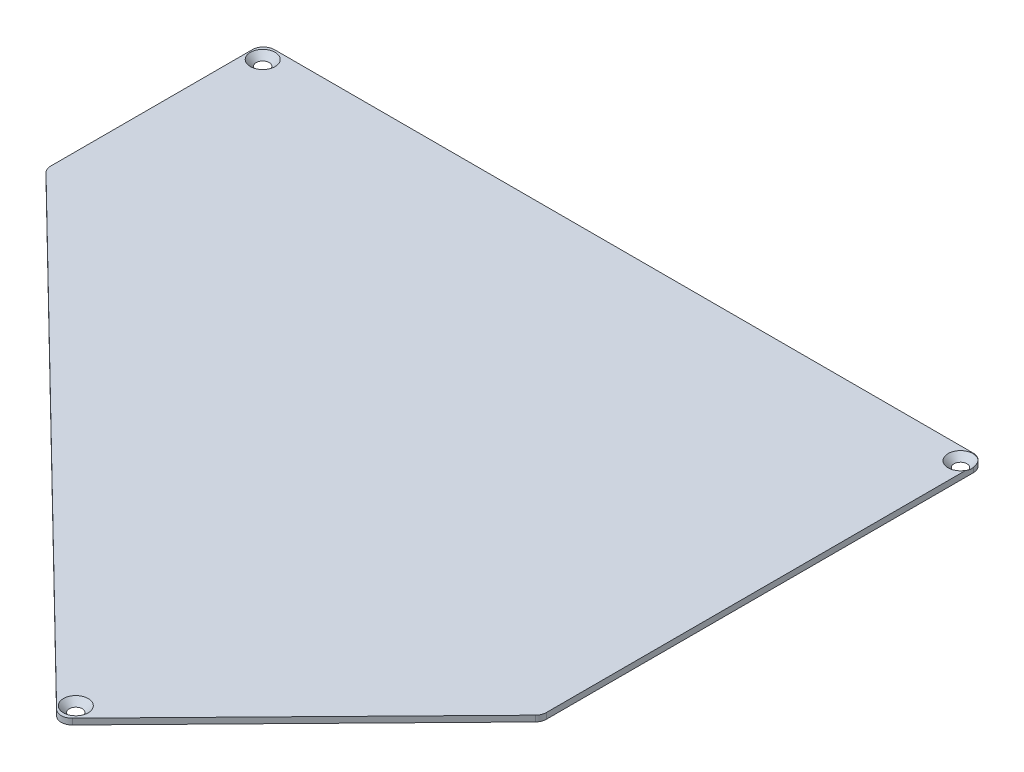
ISO-10303-21;
HEADER;
FILE_DESCRIPTION(('STEP AP214'),'2;1');
FILE_NAME('part.step','',(''),(''),'','','');
FILE_SCHEMA(('AUTOMOTIVE_DESIGN { 1 0 10303 214 1 1 1 1 }'));
ENDSEC;
DATA;
#1=APPLICATION_CONTEXT('core data for automotive mechanical design processes');
#2=APPLICATION_PROTOCOL_DEFINITION('international standard','automotive_design',2000,#1);
#3=PRODUCT_CONTEXT('',#1,'mechanical');
#4=PRODUCT('Part','Part','',(#3));
#5=PRODUCT_RELATED_PRODUCT_CATEGORY('part','',(#4));
#6=PRODUCT_DEFINITION_FORMATION('','',#4);
#7=PRODUCT_DEFINITION_CONTEXT('part definition',#1,'design');
#8=PRODUCT_DEFINITION('design','',#6,#7);
#9=PRODUCT_DEFINITION_SHAPE('','',#8);
#10=(LENGTH_UNIT() NAMED_UNIT(*) SI_UNIT(.MILLI.,.METRE.));
#11=(NAMED_UNIT(*) PLANE_ANGLE_UNIT() SI_UNIT($,.RADIAN.));
#12=(NAMED_UNIT(*) SI_UNIT($,.STERADIAN.) SOLID_ANGLE_UNIT());
#13=UNCERTAINTY_MEASURE_WITH_UNIT(LENGTH_MEASURE(1.E-05),#10,'distance_accuracy_value','');
#14=(GEOMETRIC_REPRESENTATION_CONTEXT(3) GLOBAL_UNCERTAINTY_ASSIGNED_CONTEXT((#13)) GLOBAL_UNIT_ASSIGNED_CONTEXT((#10,
#11,#12)) REPRESENTATION_CONTEXT('',''));
#15=CARTESIAN_POINT('',(0.,0.,0.));
#16=DIRECTION('',(0.,0.,1.));
#17=DIRECTION('',(1.,0.,0.));
#18=AXIS2_PLACEMENT_3D('',#15,#16,#17);
#19=CARTESIAN_POINT('',(83.0214751405466,1.5,72.4239902038868));
#20=DIRECTION('',(0.,-1.,0.));
#21=DIRECTION('',(0.,0.,-1.));
#22=AXIS2_PLACEMENT_3D('',#19,#20,#21);
#23=CYLINDRICAL_SURFACE('',#22,2.80000000000001);
#24=CARTESIAN_POINT('',(83.0214751405466,0.,72.4239902038868));
#25=DIRECTION('',(0.,1.,0.));
#26=DIRECTION('',(0.,0.,1.));
#27=AXIS2_PLACEMENT_3D('',#24,#25,#26);
#28=CIRCLE('',#27,2.80000000000001);
#29=CARTESIAN_POINT('',(81.0642976482748,0.,74.4263528742701));
#30=VERTEX_POINT('',#29);
#31=CARTESIAN_POINT('',(85.0238378109299,0.,74.3811676961587));
#32=VERTEX_POINT('',#31);
#33=EDGE_CURVE('E156',#30,#32,#28,.T.);
#34=ORIENTED_EDGE('',*,*,#33,.T.);
#35=DIRECTION('',(0.,-1.,0.));
#36=VECTOR('',#35,1.);
#37=CARTESIAN_POINT('',(85.0238378109299,1.5,74.3811676961587));
#38=LINE('',#37,#36);
#39=CARTESIAN_POINT('',(85.0238378109299,1.5,74.3811676961587));
#40=VERTEX_POINT('',#39);
#41=EDGE_CURVE('E11',#40,#32,#38,.T.);
#42=ORIENTED_EDGE('',*,*,#41,.F.);
#43=CARTESIAN_POINT('',(83.0214751405466,1.5,72.4239902038868));
#44=DIRECTION('',(0.,1.,0.));
#45=DIRECTION('',(0.,0.,1.));
#46=AXIS2_PLACEMENT_3D('',#43,#44,#45);
#47=CIRCLE('',#46,2.80000000000001);
#48=CARTESIAN_POINT('',(81.0642976482748,1.5,74.4263528742701));
#49=VERTEX_POINT('',#48);
#50=EDGE_CURVE('E177',#49,#40,#47,.T.);
#51=ORIENTED_EDGE('',*,*,#50,.F.);
#52=DIRECTION('',(0.,-1.,0.));
#53=VECTOR('',#52,1.);
#54=CARTESIAN_POINT('',(81.0642976482748,1.5,74.4263528742701));
#55=LINE('',#54,#53);
#56=EDGE_CURVE('E152',#49,#30,#55,.T.);
#57=ORIENTED_EDGE('',*,*,#56,.T.);
#58=EDGE_LOOP('',(#34,#42,#51,#57));
#59=FACE_BOUND('',#58,.T.);
#60=ADVANCED_FACE('F38',(#59),#23,.T.);
#61=CARTESIAN_POINT('',(85.0238378109299,1.5,74.3811676961587));
#62=DIRECTION('',(-0.715129525136879,0.,-0.698991961525668));
#63=DIRECTION('',(-0.698991961525668,0.,0.715129525136879));
#64=AXIS2_PLACEMENT_3D('',#61,#62,#63);
#65=PLANE('',#64);
#66=DIRECTION('',(0.698991961525668,0.,-0.715129525136879));
#67=VECTOR('',#66,1.);
#68=CARTESIAN_POINT('',(85.0238378109299,0.,74.3811676961587));
#69=LINE('',#68,#67);
#70=CARTESIAN_POINT('',(143.22520854545,0.,14.8361072281573));
#71=VERTEX_POINT('',#70);
#72=EDGE_CURVE('E159',#32,#71,#69,.T.);
#73=ORIENTED_EDGE('',*,*,#72,.T.);
#74=DIRECTION('',(0.,-1.,0.));
#75=VECTOR('',#74,1.);
#76=CARTESIAN_POINT('',(143.22520854545,1.5,14.8361072281573));
#77=LINE('',#76,#75);
#78=CARTESIAN_POINT('',(143.22520854545,1.5,14.8361072281573));
#79=VERTEX_POINT('',#78);
#80=EDGE_CURVE('E45',#79,#71,#77,.T.);
#81=ORIENTED_EDGE('',*,*,#80,.F.);
#82=DIRECTION('',(0.698991961525668,0.,-0.715129525136879));
#83=VECTOR('',#82,1.);
#84=CARTESIAN_POINT('',(85.0238378109299,1.5,74.3811676961587));
#85=LINE('',#84,#83);
#86=EDGE_CURVE('E108',#40,#79,#85,.T.);
#87=ORIENTED_EDGE('',*,*,#86,.F.);
#88=ORIENTED_EDGE('',*,*,#41,.T.);
#89=EDGE_LOOP('',(#73,#81,#87,#88));
#90=FACE_BOUND('',#89,.T.);
#91=ADVANCED_FACE('F289',(#90),#65,.F.);
#92=CARTESIAN_POINT('',(141.222845875067,1.5,12.8789297358855));
#93=DIRECTION('',(0.,-1.,0.));
#94=DIRECTION('',(0.,0.,-1.));
#95=AXIS2_PLACEMENT_3D('',#92,#93,#94);
#96=CYLINDRICAL_SURFACE('',#95,2.79999999999999);
#97=CARTESIAN_POINT('',(141.222845875067,0.,12.8789297358855));
#98=DIRECTION('',(0.,1.,0.));
#99=DIRECTION('',(0.,0.,1.));
#100=AXIS2_PLACEMENT_3D('',#97,#98,#99);
#101=CIRCLE('',#100,2.79999999999999);
#102=CARTESIAN_POINT('',(144.022845875067,0.,12.8789297358855));
#103=VERTEX_POINT('',#102);
#104=EDGE_CURVE('E162',#71,#103,#101,.T.);
#105=ORIENTED_EDGE('',*,*,#104,.T.);
#106=DIRECTION('',(0.,-1.,0.));
#107=VECTOR('',#106,1.);
#108=CARTESIAN_POINT('',(144.022845875067,1.5,12.8789297358855));
#109=LINE('',#108,#107);
#110=CARTESIAN_POINT('',(144.022845875067,1.5,12.8789297358855));
#111=VERTEX_POINT('',#110);
#112=EDGE_CURVE('E189',#111,#103,#109,.T.);
#113=ORIENTED_EDGE('',*,*,#112,.F.);
#114=CARTESIAN_POINT('',(141.222845875067,1.5,12.8789297358855));
#115=DIRECTION('',(0.,1.,0.));
#116=DIRECTION('',(0.,0.,1.));
#117=AXIS2_PLACEMENT_3D('',#114,#115,#116);
#118=CIRCLE('',#117,2.79999999999999);
#119=EDGE_CURVE('E197',#79,#111,#118,.T.);
#120=ORIENTED_EDGE('',*,*,#119,.F.);
#121=ORIENTED_EDGE('',*,*,#80,.T.);
#122=EDGE_LOOP('',(#105,#113,#120,#121));
#123=FACE_BOUND('',#122,.T.);
#124=ADVANCED_FACE('F195',(#123),#96,.T.);
#125=CARTESIAN_POINT('',(144.022845875067,1.5,12.8789297358855));
#126=DIRECTION('',(-1.,0.,0.));
#127=DIRECTION('',(0.,0.,1.));
#128=AXIS2_PLACEMENT_3D('',#125,#126,#127);
#129=PLANE('',#128);
#130=DIRECTION('',(0.,-1.,0.));
#131=VECTOR('',#130,1.);
#132=CARTESIAN_POINT('',(144.022845875067,1.5,-95.7041969985692));
#133=LINE('',#132,#131);
#134=CARTESIAN_POINT('',(144.022845875067,1.18781024153622,-95.7041969985692));
#135=VERTEX_POINT('',#134);
#136=CARTESIAN_POINT('',(144.022845875067,0.,-95.7041969985692));
#137=VERTEX_POINT('',#136);
#138=EDGE_CURVE('E187',#135,#137,#133,.T.);
#139=ORIENTED_EDGE('',*,*,#138,.F.);
#140=CARTESIAN_POINT('',(144.022845875067,2.5174754461105,-98.2968794308544));
#141=CARTESIAN_POINT('',(144.022845875067,2.4578416090348,-98.2164989542502));
#142=CARTESIAN_POINT('',(144.022845875067,2.39885674116238,-98.1356280249748));
#143=CARTESIAN_POINT('',(144.022845875067,2.28249146769985,-97.9727003048523));
#144=CARTESIAN_POINT('',(144.022845875067,2.22511160930745,-97.8906431236953));
#145=CARTESIAN_POINT('',(144.022845875067,2.1117175817814,-97.724332521911));
#146=CARTESIAN_POINT('',(144.022845875067,2.05572379084998,-97.6400651416734));
#147=CARTESIAN_POINT('',(144.022845875067,1.94619272788435,-97.4699580390067));
#148=CARTESIAN_POINT('',(144.022845875067,1.89265522120174,-97.3841184678695));
#149=CARTESIAN_POINT('',(144.022845875067,1.78642448155692,-97.2069653638458));
#150=CARTESIAN_POINT('',(144.022845875067,1.73386067612862,-97.1155731926114));
#151=CARTESIAN_POINT('',(144.022845875067,1.63289208972066,-96.9305295027223));
#152=CARTESIAN_POINT('',(144.022845875067,1.58448814813126,-96.8368775329383));
#153=CARTESIAN_POINT('',(144.022845875067,1.44750366393238,-96.5528402659925));
#154=CARTESIAN_POINT('',(144.022845875067,1.36657479774978,-96.3584546573322));
#155=CARTESIAN_POINT('',(144.022845875067,1.27812301382192,-96.0848830969306));
#156=CARTESIAN_POINT('',(144.022845875067,1.25646284576341,-96.0102177084435));
#157=CARTESIAN_POINT('',(144.022845875067,1.21832938605859,-95.8595309537962));
#158=CARTESIAN_POINT('',(144.022845875067,1.20185743588069,-95.7835092423044));
#159=CARTESIAN_POINT('',(144.022845875067,1.17487213352282,-95.6311607299349));
#160=CARTESIAN_POINT('',(144.022845875067,1.16430295587567,-95.5548439082205));
#161=CARTESIAN_POINT('',(144.022845875067,1.14934201222248,-95.4015847219888));
#162=CARTESIAN_POINT('',(144.022845875067,1.1449511809217,-95.3246422645913));
#163=CARTESIAN_POINT('',(144.022845875067,1.14267845930545,-95.1786177197707));
#164=CARTESIAN_POINT('',(144.022845875067,1.14417102264108,-95.1095447391086));
#165=CARTESIAN_POINT('',(144.022845875067,1.15222939710157,-94.9716951807934));
#166=CARTESIAN_POINT('',(144.022845875067,1.15879536773246,-94.9029186125277));
#167=CARTESIAN_POINT('',(144.022845875067,1.17678035605262,-94.7658498707027));
#168=CARTESIAN_POINT('',(144.022845875067,1.18821036090908,-94.6975591518754));
#169=CARTESIAN_POINT('',(144.022845875067,1.21553947112818,-94.5618812866275));
#170=CARTESIAN_POINT('',(144.022845875067,1.23143918856618,-94.4944942652828));
#171=CARTESIAN_POINT('',(144.022845875067,1.28236665023942,-94.3043598418632));
#172=CARTESIAN_POINT('',(144.022845875067,1.32221221602265,-94.1828926903758));
#173=CARTESIAN_POINT('',(144.022845875067,1.41252359585929,-93.9439736303907));
#174=CARTESIAN_POINT('',(144.022845875067,1.46299897963761,-93.8265254515731));
#175=CARTESIAN_POINT('',(144.022845875067,1.57258577452615,-93.5940653761977));
#176=CARTESIAN_POINT('',(144.022845875067,1.63179254752807,-93.4790989211615));
#177=CARTESIAN_POINT('',(144.022845875067,1.72517574794358,-93.3092375864666));
#178=CARTESIAN_POINT('',(144.022845875067,1.75705974428193,-93.2530580272296));
#179=CARTESIAN_POINT('',(144.022845875067,1.82216281942444,-93.1414805645701));
#180=CARTESIAN_POINT('',(144.022845875067,1.85538182966014,-93.0860826211997));
#181=CARTESIAN_POINT('',(144.022845875067,1.97134214727385,-92.8972201152352));
#182=CARTESIAN_POINT('',(144.022845875067,2.05691919806155,-92.7654946936719));
#183=CARTESIAN_POINT('',(144.022845875067,2.23300256673905,-92.5053663816018));
#184=CARTESIAN_POINT('',(144.022845875067,2.32351029669393,-92.3769644585855));
#185=CARTESIAN_POINT('',(144.022845875067,2.50825741338781,-92.122709015452));
#186=CARTESIAN_POINT('',(144.022845875067,2.60250005534075,-91.9968578695779));
#187=CARTESIAN_POINT('',(144.022845875067,2.79376317589313,-91.7472787555964));
#188=CARTESIAN_POINT('',(144.022845875067,2.89078386208582,-91.6235509472692));
#189=CARTESIAN_POINT('',(144.022845875067,3.08737539010931,-91.3773082826497));
#190=CARTESIAN_POINT('',(144.022845875067,3.18695507781303,-91.2548005062153));
#191=CARTESIAN_POINT('',(144.022845875067,3.3878268908647,-91.0111951304536));
#192=CARTESIAN_POINT('',(144.022845875067,3.4891190599987,-90.8900975673178));
#193=CARTESIAN_POINT('',(144.022845875067,3.79492014758252,-90.5286669456757));
#194=CARTESIAN_POINT('',(144.022845875067,4.00146540016445,-90.2900576627691));
#195=CARTESIAN_POINT('',(144.022845875067,4.39436468921282,-89.8431251264288));
#196=CARTESIAN_POINT('',(144.022845875067,4.58032878986242,-89.6344569349586));
#197=CARTESIAN_POINT('',(144.022845875067,4.95438151925747,-89.2189761856086));
#198=CARTESIAN_POINT('',(144.022845875067,5.14247047259345,-89.0121639201388));
#199=CARTESIAN_POINT('',(144.022845875067,5.5186505168506,-88.6016909436965));
#200=CARTESIAN_POINT('',(144.022845875067,5.70672863743755,-88.3980183216814));
#201=CARTESIAN_POINT('',(144.022845875067,6.08406279141988,-87.9918408677799));
#202=CARTESIAN_POINT('',(144.022845875067,6.27331858687651,-87.7893358149676));
#203=CARTESIAN_POINT('',(144.022845875067,6.46301733485952,-87.5872498864537));
#204=B_SPLINE_CURVE_WITH_KNOTS('',3,(#140,#141,#142,#143,#144,#145,#146,#147,#148,#149,#150,
#151,#152,#153,#154,#155,#156,#157,#158,#159,#160,#161,#162,#163,#164,#165,#166,#167,#168,#169,
#170,#171,#172,#173,#174,#175,#176,#177,#178,#179,#180,#181,#182,#183,#184,#185,#186,#187,#188,
#189,#190,#191,#192,#193,#194,#195,#196,#197,#198,#199,#200,#201,#202,#203),.UNSPECIFIED.,.F.,
.F.,(4,2,2,2,2,2,2,2,2,2,2,2,2,2,2,2,2,2,2,2,2,2,2,2,2,2,2,2,2,2,2,4),(0.,0.300265366793843,
0.600631885588552,0.904118556642977,1.20757617504386,1.52375216724069,1.83999180934637,
2.46922805179001,2.7023138700652,2.93545990575681,3.16636191361514,3.39729885025726,
3.60437889555033,3.81146545162704,4.01902229100754,4.22660756674932,4.60940267434812,
4.99254388616842,5.38023113349006,5.57400772892049,5.76777438436131,6.23884694308673,
6.71005512575138,7.18168343999773,7.65334708978202,8.12695025049931,8.6005655390387,
9.54726285171596,10.3857742639415,11.2244155466282,12.0560974101456,12.8876163685992),.UNSPECIFIED.);
#205=CARTESIAN_POINT('',(144.022845875067,1.5,-93.7484040761271));
#206=VERTEX_POINT('',#205);
#207=EDGE_CURVE('E52',#135,#206,#204,.T.);
#208=ORIENTED_EDGE('',*,*,#207,.T.);
#209=DIRECTION('',(0.,0.,-1.));
#210=VECTOR('',#209,1.);
#211=CARTESIAN_POINT('',(144.022845875067,1.5,12.8789297358855));
#212=LINE('',#211,#210);
#213=EDGE_CURVE('E209',#111,#206,#212,.T.);
#214=ORIENTED_EDGE('',*,*,#213,.F.);
#215=ORIENTED_EDGE('',*,*,#112,.T.);
#216=DIRECTION('',(0.,0.,-1.));
#217=VECTOR('',#216,1.);
#218=CARTESIAN_POINT('',(144.022845875067,0.,12.8789297358855));
#219=LINE('',#218,#217);
#220=EDGE_CURVE('E164',#103,#137,#219,.T.);
#221=ORIENTED_EDGE('',*,*,#220,.T.);
#222=EDGE_LOOP('',(#139,#208,#214,#215,#221));
#223=FACE_BOUND('',#222,.T.);
#224=ADVANCED_FACE('F206',(#223),#129,.F.);
#225=CARTESIAN_POINT('',(141.222845875067,1.5,-95.7041969985692));
#226=DIRECTION('',(0.,-1.,0.));
#227=DIRECTION('',(0.,0.,-1.));
#228=AXIS2_PLACEMENT_3D('',#225,#226,#227);
#229=CYLINDRICAL_SURFACE('',#228,2.80000000000001);
#230=CARTESIAN_POINT('',(141.222845875067,1.5,-95.7041969985692));
#231=DIRECTION('',(0.,1.,0.));
#232=DIRECTION('',(0.,0.,1.));
#233=AXIS2_PLACEMENT_3D('',#230,#231,#232);
#234=CIRCLE('',#233,2.80000000000001);
#235=CARTESIAN_POINT('',(143.31576797873,1.5,-97.5642177156573));
#236=VERTEX_POINT('',#235);
#237=CARTESIAN_POINT('',(141.222845875067,1.5,-98.5041969985692));
#238=VERTEX_POINT('',#237);
#239=EDGE_CURVE('E211',#236,#238,#234,.T.);
#240=ORIENTED_EDGE('',*,*,#239,.F.);
#241=CARTESIAN_POINT('',(141.474142455751,1.64779231773631,-98.4928974178572));
#242=CARTESIAN_POINT('',(141.554910839805,1.64652845512919,-98.4856286568766));
#243=CARTESIAN_POINT('',(141.635348571453,1.64473090141302,-98.4748335653745));
#244=CARTESIAN_POINT('',(141.794954099136,1.64008207098887,-98.4463221113913));
#245=CARTESIAN_POINT('',(141.874121943831,1.63723083475854,-98.428606014782));
#246=CARTESIAN_POINT('',(142.030703940813,1.63048308943283,-98.3863513636086));
#247=CARTESIAN_POINT('',(142.108115253144,1.62658500256355,-98.3618025089182));
#248=CARTESIAN_POINT('',(142.260442766419,1.6177691446716,-98.3061147849697));
#249=CARTESIAN_POINT('',(142.335359107785,1.61285143114881,-98.2749762873198));
#250=CARTESIAN_POINT('',(142.555594114494,1.59659867526131,-98.1719905085567));
#251=CARTESIAN_POINT('',(142.696447480132,1.58376192176468,-98.0905597170842));
#252=CARTESIAN_POINT('',(142.961303417591,1.55440756246695,-97.9050639818099));
#253=CARTESIAN_POINT('',(143.085358791737,1.53790194286045,-97.8010727689226));
#254=CARTESIAN_POINT('',(143.219128331858,1.51659781845056,-97.6677767183471));
#255=CARTESIAN_POINT('',(143.238667693603,1.51338729927088,-97.6477108888716));
#256=CARTESIAN_POINT('',(143.277129318915,1.5068676628494,-97.6070116372814));
#257=CARTESIAN_POINT('',(143.296051579954,1.50355854520366,-97.5863782128413));
#258=CARTESIAN_POINT('',(143.417793325492,1.48158649523042,-97.4495492136092));
#259=CARTESIAN_POINT('',(143.511300501239,1.46145481115403,-97.324985263393));
#260=CARTESIAN_POINT('',(143.67643793726,1.41857599124168,-97.0621657933929));
#261=CARTESIAN_POINT('',(143.748004842709,1.39582153742892,-96.9238721218651));
#262=CARTESIAN_POINT('',(143.868317045229,1.3477660345182,-96.635008357104));
#263=CARTESIAN_POINT('',(143.916614826425,1.32242560610826,-96.4842582500797));
#264=CARTESIAN_POINT('',(143.987048565871,1.27018310319937,-96.1773499725472));
#265=CARTESIAN_POINT('',(144.009251502418,1.24328521351169,-96.0212067111055));
#266=CARTESIAN_POINT('',(144.021320540236,1.20660363155572,-95.8111056639811));
#267=CARTESIAN_POINT('',(144.022852420174,1.19721175418115,-95.7575545807343));
#268=CARTESIAN_POINT('',(144.022833121336,1.16941697825052,-95.5998073909762));
#269=CARTESIAN_POINT('',(144.016998199987,1.15088912892822,-95.4955931883194));
#270=CARTESIAN_POINT('',(143.993735461034,1.11364985896318,-95.2880535212121));
#271=CARTESIAN_POINT('',(143.976260162912,1.09493799700065,-95.1847334596381));
#272=CARTESIAN_POINT('',(143.953014914261,1.07628964426686,-95.0827655724037));
#273=B_SPLINE_CURVE_WITH_KNOTS('',3,(#241,#242,#243,#244,#245,#246,#247,#248,#249,#250,#251,
#252,#253,#254,#255,#256,#257,#258,#259,#260,#261,#262,#263,#264,#265,#266,#267,#268,#269,#270,
#271,#272),.UNSPECIFIED.,.F.,.F.,(4,2,2,2,2,2,2,2,2,2,2,2,2,2,2,4),(0.,0.243227464293737,
0.48644558587482,0.730032354122679,0.973605389497453,1.46060198104135,1.94603034604723,
2.0305986555923,2.11516731165629,2.583858065405,3.05388973470529,3.5326321646183,
4.01014309189784,4.17326548869031,4.49059980111408,4.80923649614431),.UNSPECIFIED.);
#274=EDGE_CURVE('E245',#236,#135,#273,.T.);
#275=ORIENTED_EDGE('',*,*,#274,.T.);
#276=ORIENTED_EDGE('',*,*,#138,.T.);
#277=CARTESIAN_POINT('',(141.222845875067,0.,-95.7041969985692));
#278=DIRECTION('',(0.,1.,0.));
#279=DIRECTION('',(0.,0.,1.));
#280=AXIS2_PLACEMENT_3D('',#277,#278,#279);
#281=CIRCLE('',#280,2.80000000000001);
#282=CARTESIAN_POINT('',(141.222845875067,0.,-98.5041969985692));
#283=VERTEX_POINT('',#282);
#284=EDGE_CURVE('E167',#137,#283,#281,.T.);
#285=ORIENTED_EDGE('',*,*,#284,.T.);
#286=DIRECTION('',(0.,-1.,0.));
#287=VECTOR('',#286,1.);
#288=CARTESIAN_POINT('',(141.222845875067,1.5,-98.5041969985692));
#289=LINE('',#288,#287);
#290=EDGE_CURVE('E184',#238,#283,#289,.T.);
#291=ORIENTED_EDGE('',*,*,#290,.F.);
#292=EDGE_LOOP('',(#240,#275,#276,#285,#291));
#293=FACE_BOUND('',#292,.T.);
#294=ADVANCED_FACE('F281',(#293),#229,.T.);
#295=CARTESIAN_POINT('',(141.222845875067,1.5,-98.5041969985692));
#296=DIRECTION('',(0.,0.,1.));
#297=DIRECTION('',(1.,0.,0.));
#298=AXIS2_PLACEMENT_3D('',#295,#296,#297);
#299=PLANE('',#298);
#300=DIRECTION('',(-1.,0.,0.));
#301=VECTOR('',#300,1.);
#302=CARTESIAN_POINT('',(141.222845875067,0.,-98.5041969985692));
#303=LINE('',#302,#301);
#304=CARTESIAN_POINT('',(-36.4911848402839,0.,-98.5041969985692));
#305=VERTEX_POINT('',#304);
#306=EDGE_CURVE('E169',#283,#305,#303,.T.);
#307=ORIENTED_EDGE('',*,*,#306,.T.);
#308=DIRECTION('',(0.,-1.,0.));
#309=VECTOR('',#308,1.);
#310=CARTESIAN_POINT('',(-36.4911848402839,1.5,-98.5041969985692));
#311=LINE('',#310,#309);
#312=CARTESIAN_POINT('',(-36.4911848402839,1.5,-98.5041969985692));
#313=VERTEX_POINT('',#312);
#314=EDGE_CURVE('E181',#313,#305,#311,.T.);
#315=ORIENTED_EDGE('',*,*,#314,.F.);
#316=DIRECTION('',(-1.,0.,0.));
#317=VECTOR('',#316,1.);
#318=CARTESIAN_POINT('',(141.222845875067,1.5,-98.5041969985692));
#319=LINE('',#318,#317);
#320=EDGE_CURVE('E213',#238,#313,#319,.T.);
#321=ORIENTED_EDGE('',*,*,#320,.F.);
#322=ORIENTED_EDGE('',*,*,#290,.T.);
#323=EDGE_LOOP('',(#307,#315,#321,#322));
#324=FACE_BOUND('',#323,.T.);
#325=ADVANCED_FACE('F223',(#324),#299,.F.);
#326=CARTESIAN_POINT('',(-36.4911848402839,1.5,-95.7041969985692));
#327=DIRECTION('',(0.,-1.,0.));
#328=DIRECTION('',(0.,0.,-1.));
#329=AXIS2_PLACEMENT_3D('',#326,#327,#328);
#330=CYLINDRICAL_SURFACE('',#329,2.8);
#331=CARTESIAN_POINT('',(-36.4911848402839,0.,-95.7041969985692));
#332=DIRECTION('',(0.,1.,0.));
#333=DIRECTION('',(0.,0.,1.));
#334=AXIS2_PLACEMENT_3D('',#331,#332,#333);
#335=CIRCLE('',#334,2.8);
#336=CARTESIAN_POINT('',(-39.2911848402839,0.,-95.7041969985692));
#337=VERTEX_POINT('',#336);
#338=EDGE_CURVE('E171',#305,#337,#335,.T.);
#339=ORIENTED_EDGE('',*,*,#338,.T.);
#340=DIRECTION('',(0.,-1.,0.));
#341=VECTOR('',#340,1.);
#342=CARTESIAN_POINT('',(-39.2911848402839,1.5,-95.7041969985692));
#343=LINE('',#342,#341);
#344=CARTESIAN_POINT('',(-39.2911848402839,1.5,-95.7041969985692));
#345=VERTEX_POINT('',#344);
#346=EDGE_CURVE('E147',#345,#337,#343,.T.);
#347=ORIENTED_EDGE('',*,*,#346,.F.);
#348=CARTESIAN_POINT('',(-36.4911848402839,1.5,-95.7041969985692));
#349=DIRECTION('',(0.,1.,0.));
#350=DIRECTION('',(0.,0.,1.));
#351=AXIS2_PLACEMENT_3D('',#348,#349,#350);
#352=CIRCLE('',#351,2.8);
#353=EDGE_CURVE('E135',#313,#345,#352,.T.);
#354=ORIENTED_EDGE('',*,*,#353,.F.);
#355=ORIENTED_EDGE('',*,*,#314,.T.);
#356=EDGE_LOOP('',(#339,#347,#354,#355));
#357=FACE_BOUND('',#356,.T.);
#358=ADVANCED_FACE('F226',(#357),#330,.T.);
#359=CARTESIAN_POINT('',(-39.2911848402839,1.5,-95.7041969985692));
#360=DIRECTION('',(1.,0.,0.));
#361=DIRECTION('',(0.,0.,-1.));
#362=AXIS2_PLACEMENT_3D('',#359,#360,#361);
#363=PLANE('',#362);
#364=DIRECTION('',(0.,0.,1.));
#365=VECTOR('',#364,1.);
#366=CARTESIAN_POINT('',(-39.2911848402839,0.,-95.7041969985692));
#367=LINE('',#366,#365);
#368=CARTESIAN_POINT('',(-39.2911848402839,0.,-44.3917553229971));
#369=VERTEX_POINT('',#368);
#370=EDGE_CURVE('E144',#337,#369,#367,.T.);
#371=ORIENTED_EDGE('',*,*,#370,.T.);
#372=DIRECTION('',(0.,-1.,0.));
#373=VECTOR('',#372,1.);
#374=CARTESIAN_POINT('',(-39.2911848402839,1.5,-44.3917553229971));
#375=LINE('',#374,#373);
#376=CARTESIAN_POINT('',(-39.2911848402839,1.5,-44.3917553229971));
#377=VERTEX_POINT('',#376);
#378=EDGE_CURVE('E141',#377,#369,#375,.T.);
#379=ORIENTED_EDGE('',*,*,#378,.F.);
#380=DIRECTION('',(0.,0.,1.));
#381=VECTOR('',#380,1.);
#382=CARTESIAN_POINT('',(-39.2911848402839,1.5,-95.7041969985692));
#383=LINE('',#382,#381);
#384=EDGE_CURVE('E126',#345,#377,#383,.T.);
#385=ORIENTED_EDGE('',*,*,#384,.F.);
#386=ORIENTED_EDGE('',*,*,#346,.T.);
#387=EDGE_LOOP('',(#371,#379,#385,#386));
#388=FACE_BOUND('',#387,.T.);
#389=ADVANCED_FACE('F142',(#388),#363,.F.);
#390=CARTESIAN_POINT('',(-36.4911848402839,1.5,-44.3917553229971));
#391=DIRECTION('',(0.,-1.,0.));
#392=DIRECTION('',(0.,0.,-1.));
#393=AXIS2_PLACEMENT_3D('',#390,#391,#392);
#394=CYLINDRICAL_SURFACE('',#393,2.8);
#395=CARTESIAN_POINT('',(-36.4911848402839,0.,-44.3917553229971));
#396=DIRECTION('',(0.,1.,0.));
#397=DIRECTION('',(0.,0.,1.));
#398=AXIS2_PLACEMENT_3D('',#395,#396,#397);
#399=CIRCLE('',#398,2.8);
#400=CARTESIAN_POINT('',(-38.4483623325558,0.,-42.3893926526139));
#401=VERTEX_POINT('',#400);
#402=EDGE_CURVE('E174',#369,#401,#399,.T.);
#403=ORIENTED_EDGE('',*,*,#402,.T.);
#404=DIRECTION('',(0.,-1.,0.));
#405=VECTOR('',#404,1.);
#406=CARTESIAN_POINT('',(-38.4483623325558,1.5,-42.3893926526139));
#407=LINE('',#406,#405);
#408=CARTESIAN_POINT('',(-38.4483623325558,1.5,-42.3893926526139));
#409=VERTEX_POINT('',#408);
#410=EDGE_CURVE('E148',#409,#401,#407,.T.);
#411=ORIENTED_EDGE('',*,*,#410,.F.);
#412=CARTESIAN_POINT('',(-36.4911848402839,1.5,-44.3917553229971));
#413=DIRECTION('',(0.,1.,0.));
#414=DIRECTION('',(0.,0.,1.));
#415=AXIS2_PLACEMENT_3D('',#412,#413,#414);
#416=CIRCLE('',#415,2.8);
#417=EDGE_CURVE('E132',#377,#409,#416,.T.);
#418=ORIENTED_EDGE('',*,*,#417,.F.);
#419=ORIENTED_EDGE('',*,*,#378,.T.);
#420=EDGE_LOOP('',(#403,#411,#418,#419));
#421=FACE_BOUND('',#420,.T.);
#422=ADVANCED_FACE('F150',(#421),#394,.T.);
#423=CARTESIAN_POINT('',(-38.4483623325558,1.5,-42.3893926526139));
#424=DIRECTION('',(0.698991961525669,0.,-0.715129525136879));
#425=DIRECTION('',(-0.715129525136879,0.,-0.698991961525669));
#426=AXIS2_PLACEMENT_3D('',#423,#424,#425);
#427=PLANE('',#426);
#428=DIRECTION('',(0.715129525136879,0.,0.698991961525669));
#429=VECTOR('',#428,1.);
#430=CARTESIAN_POINT('',(-38.4483623325558,0.,-42.3893926526139));
#431=LINE('',#430,#429);
#432=EDGE_CURVE('E100',#401,#30,#431,.T.);
#433=ORIENTED_EDGE('',*,*,#432,.T.);
#434=ORIENTED_EDGE('',*,*,#56,.F.);
#435=DIRECTION('',(0.715129525136879,0.,0.698991961525669));
#436=VECTOR('',#435,1.);
#437=CARTESIAN_POINT('',(-38.4483623325558,1.5,-42.3893926526139));
#438=LINE('',#437,#436);
#439=EDGE_CURVE('E61',#409,#49,#438,.T.);
#440=ORIENTED_EDGE('',*,*,#439,.F.);
#441=ORIENTED_EDGE('',*,*,#410,.T.);
#442=EDGE_LOOP('',(#433,#434,#440,#441));
#443=FACE_BOUND('',#442,.T.);
#444=ADVANCED_FACE('F227',(#443),#427,.F.);
#445=CARTESIAN_POINT('',(83.0214751405466,1.5,72.4239902038868));
#446=DIRECTION('',(0.,1.,0.));
#447=DIRECTION('',(0.,0.,1.));
#448=AXIS2_PLACEMENT_3D('',#445,#446,#447);
#449=PLANE('',#448);
#450=CARTESIAN_POINT('',(-35.8104962460012,1.5,-94.850130039741));
#451=DIRECTION('',(0.,1.,0.));
#452=DIRECTION('',(0.,0.,1.));
#453=AXIS2_PLACEMENT_3D('',#450,#451,#452);
#454=CIRCLE('',#453,3.15);
#455=CARTESIAN_POINT('',(-35.8104962460012,1.5,-91.700130039741));
#456=VERTEX_POINT('',#455);
#457=EDGE_CURVE('E354',#456,#456,#454,.T.);
#458=ORIENTED_EDGE('',*,*,#457,.F.);
#459=EDGE_LOOP('',(#458));
#460=FACE_BOUND('',#459,.T.);
#461=CARTESIAN_POINT('',(141.229430945815,1.5,-95.2041969985691));
#462=DIRECTION('',(0.,1.,0.));
#463=DIRECTION('',(0.,0.,1.));
#464=AXIS2_PLACEMENT_3D('',#461,#462,#463);
#465=CIRCLE('',#464,3.14999999999999);
#466=EDGE_CURVE('E356',#236,#206,#465,.T.);
#467=ORIENTED_EDGE('',*,*,#466,.F.);
#468=ORIENTED_EDGE('',*,*,#239,.T.);
#469=ORIENTED_EDGE('',*,*,#320,.T.);
#470=ORIENTED_EDGE('',*,*,#353,.T.);
#471=ORIENTED_EDGE('',*,*,#384,.T.);
#472=ORIENTED_EDGE('',*,*,#417,.T.);
#473=ORIENTED_EDGE('',*,*,#439,.T.);
#474=ORIENTED_EDGE('',*,*,#50,.T.);
#475=ORIENTED_EDGE('',*,*,#86,.T.);
#476=ORIENTED_EDGE('',*,*,#119,.T.);
#477=ORIENTED_EDGE('',*,*,#213,.T.);
#478=EDGE_LOOP('',(#467,#468,#469,#470,#471,#472,#473,#474,#475,#476,#477));
#479=FACE_BOUND('',#478,.T.);
#480=CARTESIAN_POINT('',(82.7038598485183,1.5,71.1880972596087));
#481=DIRECTION('',(0.,1.,0.));
#482=DIRECTION('',(0.,0.,1.));
#483=AXIS2_PLACEMENT_3D('',#480,#481,#482);
#484=CIRCLE('',#483,3.15);
#485=CARTESIAN_POINT('',(82.7038598485183,1.5,74.3380972596087));
#486=VERTEX_POINT('',#485);
#487=EDGE_CURVE('E235',#486,#486,#484,.T.);
#488=ORIENTED_EDGE('',*,*,#487,.F.);
#489=EDGE_LOOP('',(#488));
#490=FACE_BOUND('',#489,.T.);
#491=ADVANCED_FACE('F129',(#460,#479,#490),#449,.T.);
#492=CARTESIAN_POINT('',(83.0214751405466,0.,72.4239902038868));
#493=DIRECTION('',(0.,1.,0.));
#494=DIRECTION('',(0.,0.,1.));
#495=AXIS2_PLACEMENT_3D('',#492,#493,#494);
#496=PLANE('',#495);
#497=CARTESIAN_POINT('',(-35.8104962460012,0.,-94.850130039741));
#498=DIRECTION('',(0.,1.,0.));
#499=DIRECTION('',(0.,0.,1.));
#500=AXIS2_PLACEMENT_3D('',#497,#498,#499);
#501=CIRCLE('',#500,1.65);
#502=CARTESIAN_POINT('',(-35.8104962460012,0.,-93.200130039741));
#503=VERTEX_POINT('',#502);
#504=EDGE_CURVE('E351',#503,#503,#501,.T.);
#505=ORIENTED_EDGE('',*,*,#504,.T.);
#506=EDGE_LOOP('',(#505));
#507=FACE_BOUND('',#506,.T.);
#508=CARTESIAN_POINT('',(141.229430945815,0.,-95.2041969985691));
#509=DIRECTION('',(0.,1.,0.));
#510=DIRECTION('',(0.,0.,1.));
#511=AXIS2_PLACEMENT_3D('',#508,#509,#510);
#512=CIRCLE('',#511,1.64999999999999);
#513=CARTESIAN_POINT('',(141.229430945815,0.,-93.5541969985691));
#514=VERTEX_POINT('',#513);
#515=EDGE_CURVE('E359',#514,#514,#512,.T.);
#516=ORIENTED_EDGE('',*,*,#515,.T.);
#517=EDGE_LOOP('',(#516));
#518=FACE_BOUND('',#517,.T.);
#519=CARTESIAN_POINT('',(82.7038598485183,0.,71.1880972596087));
#520=DIRECTION('',(0.,1.,0.));
#521=DIRECTION('',(0.,0.,1.));
#522=AXIS2_PLACEMENT_3D('',#519,#520,#521);
#523=CIRCLE('',#522,1.65);
#524=CARTESIAN_POINT('',(82.7038598485183,0.,72.8380972596087));
#525=VERTEX_POINT('',#524);
#526=EDGE_CURVE('E160',#525,#525,#523,.T.);
#527=ORIENTED_EDGE('',*,*,#526,.T.);
#528=EDGE_LOOP('',(#527));
#529=FACE_BOUND('',#528,.T.);
#530=ORIENTED_EDGE('',*,*,#33,.F.);
#531=ORIENTED_EDGE('',*,*,#432,.F.);
#532=ORIENTED_EDGE('',*,*,#402,.F.);
#533=ORIENTED_EDGE('',*,*,#370,.F.);
#534=ORIENTED_EDGE('',*,*,#338,.F.);
#535=ORIENTED_EDGE('',*,*,#306,.F.);
#536=ORIENTED_EDGE('',*,*,#284,.F.);
#537=ORIENTED_EDGE('',*,*,#220,.F.);
#538=ORIENTED_EDGE('',*,*,#104,.F.);
#539=ORIENTED_EDGE('',*,*,#72,.F.);
#540=EDGE_LOOP('',(#530,#531,#532,#533,#534,#535,#536,#537,#538,#539));
#541=FACE_BOUND('',#540,.T.);
#542=ADVANCED_FACE('F201',(#507,#518,#529,#541),#496,.F.);
#543=CARTESIAN_POINT('',(82.7038598485183,1.5,71.1880972596087));
#544=DIRECTION('',(0.,1.,0.));
#545=DIRECTION('',(0.,0.,1.));
#546=AXIS2_PLACEMENT_3D('',#543,#544,#545);
#547=CONICAL_SURFACE('',#546,3.15,0.785398163397447);
#548=ORIENTED_EDGE('',*,*,#526,.F.);
#549=EDGE_LOOP('',(#548));
#550=FACE_BOUND('',#549,.T.);
#551=ORIENTED_EDGE('',*,*,#487,.T.);
#552=EDGE_LOOP('',(#551));
#553=FACE_BOUND('',#552,.T.);
#554=ADVANCED_FACE('F260',(#550,#553),#547,.F.);
#555=CARTESIAN_POINT('',(141.229430945815,1.5,-95.2041969985691));
#556=DIRECTION('',(0.,1.,0.));
#557=DIRECTION('',(0.,0.,1.));
#558=AXIS2_PLACEMENT_3D('',#555,#556,#557);
#559=CONICAL_SURFACE('',#558,3.14999999999999,0.785398163397447);
#560=ORIENTED_EDGE('',*,*,#515,.F.);
#561=EDGE_LOOP('',(#560));
#562=FACE_BOUND('',#561,.T.);
#563=ORIENTED_EDGE('',*,*,#274,.F.);
#564=ORIENTED_EDGE('',*,*,#466,.T.);
#565=ORIENTED_EDGE('',*,*,#207,.F.);
#566=EDGE_LOOP('',(#563,#564,#565));
#567=FACE_BOUND('',#566,.T.);
#568=ADVANCED_FACE('F254',(#562,#567),#559,.F.);
#569=CARTESIAN_POINT('',(-35.8104962460012,1.5,-94.850130039741));
#570=DIRECTION('',(0.,1.,0.));
#571=DIRECTION('',(0.,0.,1.));
#572=AXIS2_PLACEMENT_3D('',#569,#570,#571);
#573=CONICAL_SURFACE('',#572,3.15,0.785398163397449);
#574=ORIENTED_EDGE('',*,*,#504,.F.);
#575=EDGE_LOOP('',(#574));
#576=FACE_BOUND('',#575,.T.);
#577=ORIENTED_EDGE('',*,*,#457,.T.);
#578=EDGE_LOOP('',(#577));
#579=FACE_BOUND('',#578,.T.);
#580=ADVANCED_FACE('F259',(#576,#579),#573,.F.);
#581=CLOSED_SHELL('',(#60,#91,#124,#224,#294,#325,#358,#389,#422,#444,#491,#542,#554,#568,#580));
#582=MANIFOLD_SOLID_BREP('B2',#581);
#583=ADVANCED_BREP_SHAPE_REPRESENTATION('',(#18,#582),#14);
#584=SHAPE_DEFINITION_REPRESENTATION(#9,#583);
ENDSEC;
END-ISO-10303-21;
